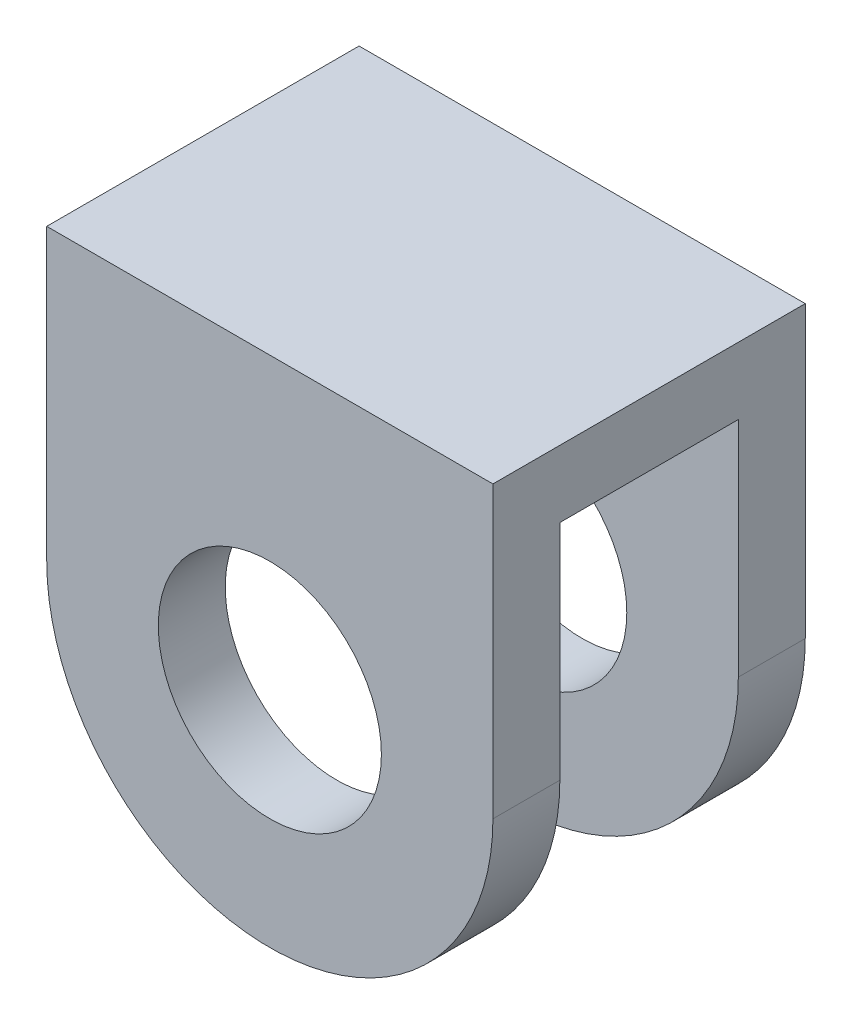
ISO-10303-21;
HEADER;
FILE_DESCRIPTION(('STEP AP214'),'2;1');
FILE_NAME('part.step','',(''),(''),'','','');
FILE_SCHEMA(('AUTOMOTIVE_DESIGN { 1 0 10303 214 1 1 1 1 }'));
ENDSEC;
DATA;
#1=APPLICATION_CONTEXT('core data for automotive mechanical design processes');
#2=APPLICATION_PROTOCOL_DEFINITION('international standard','automotive_design',2000,#1);
#3=PRODUCT_CONTEXT('',#1,'mechanical');
#4=PRODUCT('Part','Part','',(#3));
#5=PRODUCT_RELATED_PRODUCT_CATEGORY('part','',(#4));
#6=PRODUCT_DEFINITION_FORMATION('','',#4);
#7=PRODUCT_DEFINITION_CONTEXT('part definition',#1,'design');
#8=PRODUCT_DEFINITION('design','',#6,#7);
#9=PRODUCT_DEFINITION_SHAPE('','',#8);
#10=(LENGTH_UNIT() NAMED_UNIT(*) SI_UNIT(.MILLI.,.METRE.));
#11=(NAMED_UNIT(*) PLANE_ANGLE_UNIT() SI_UNIT($,.RADIAN.));
#12=(NAMED_UNIT(*) SI_UNIT($,.STERADIAN.) SOLID_ANGLE_UNIT());
#13=UNCERTAINTY_MEASURE_WITH_UNIT(LENGTH_MEASURE(1.E-05),#10,'distance_accuracy_value','');
#14=(GEOMETRIC_REPRESENTATION_CONTEXT(3) GLOBAL_UNCERTAINTY_ASSIGNED_CONTEXT((#13)) GLOBAL_UNIT_ASSIGNED_CONTEXT((#10,
#11,#12)) REPRESENTATION_CONTEXT('',''));
#15=CARTESIAN_POINT('',(0.,0.,0.));
#16=DIRECTION('',(0.,0.,1.));
#17=DIRECTION('',(1.,0.,0.));
#18=AXIS2_PLACEMENT_3D('',#15,#16,#17);
#19=CARTESIAN_POINT('',(0.,55.522572815534,0.));
#20=DIRECTION('',(0.,-1.,0.));
#21=DIRECTION('',(0.,0.,-1.));
#22=AXIS2_PLACEMENT_3D('',#19,#20,#21);
#23=PLANE('',#22);
#24=DIRECTION('',(0.,0.,1.));
#25=VECTOR('',#24,1.);
#26=CARTESIAN_POINT('',(-35.6031553398058,55.522572815534,3.));
#27=LINE('',#26,#25);
#28=CARTESIAN_POINT('',(-35.6031553398058,55.522572815534,-7.99999999999999));
#29=VERTEX_POINT('',#28);
#30=CARTESIAN_POINT('',(-35.6031553398058,55.522572815534,0.));
#31=VERTEX_POINT('',#30);
#32=EDGE_CURVE('E96',#29,#31,#27,.T.);
#33=ORIENTED_EDGE('',*,*,#32,.F.);
#34=DIRECTION('',(-1.,0.,0.));
#35=VECTOR('',#34,1.);
#36=CARTESIAN_POINT('',(-35.6031553398058,55.522572815534,-7.99999999999999));
#37=LINE('',#36,#35);
#38=CARTESIAN_POINT('',(-15.6031553398058,55.522572815534,-8.));
#39=VERTEX_POINT('',#38);
#40=EDGE_CURVE('E95',#39,#29,#37,.T.);
#41=ORIENTED_EDGE('',*,*,#40,.F.);
#42=DIRECTION('',(0.,0.,-1.));
#43=VECTOR('',#42,1.);
#44=CARTESIAN_POINT('',(-15.6031553398058,55.522572815534,-11.));
#45=LINE('',#44,#43);
#46=CARTESIAN_POINT('',(-15.6031553398058,55.522572815534,0.));
#47=VERTEX_POINT('',#46);
#48=EDGE_CURVE('E79',#47,#39,#45,.T.);
#49=ORIENTED_EDGE('',*,*,#48,.F.);
#50=DIRECTION('',(-1.,0.,0.));
#51=VECTOR('',#50,1.);
#52=CARTESIAN_POINT('',(-35.6031553398058,55.522572815534,0.));
#53=LINE('',#52,#51);
#54=EDGE_CURVE('E82',#47,#31,#53,.T.);
#55=ORIENTED_EDGE('',*,*,#54,.T.);
#56=EDGE_LOOP('',(#33,#41,#49,#55));
#57=FACE_BOUND('',#56,.T.);
#58=ADVANCED_FACE('F34',(#57),#23,.T.);
#59=CARTESIAN_POINT('',(-25.6031553398058,45.522572815534,3.));
#60=DIRECTION('',(0.,0.,1.));
#61=DIRECTION('',(1.,0.,0.));
#62=AXIS2_PLACEMENT_3D('',#59,#60,#61);
#63=PLANE('',#62);
#64=DIRECTION('',(0.,-1.,0.));
#65=VECTOR('',#64,1.);
#66=CARTESIAN_POINT('',(-35.6031553398058,45.522572815534,3.));
#67=LINE('',#66,#65);
#68=CARTESIAN_POINT('',(-35.6031553398058,58.522572815534,3.));
#69=VERTEX_POINT('',#68);
#70=CARTESIAN_POINT('',(-35.6031553398058,45.522572815534,3.));
#71=VERTEX_POINT('',#70);
#72=EDGE_CURVE('E93',#69,#71,#67,.T.);
#73=ORIENTED_EDGE('',*,*,#72,.T.);
#74=CARTESIAN_POINT('',(-25.6031553398058,45.522572815534,3.));
#75=DIRECTION('',(0.,0.,1.));
#76=DIRECTION('',(1.,0.,0.));
#77=AXIS2_PLACEMENT_3D('',#74,#75,#76);
#78=CIRCLE('',#77,10.);
#79=CARTESIAN_POINT('',(-15.6031553398058,45.522572815534,3.));
#80=VERTEX_POINT('',#79);
#81=EDGE_CURVE('E58',#71,#80,#78,.T.);
#82=ORIENTED_EDGE('',*,*,#81,.T.);
#83=DIRECTION('',(0.,1.,0.));
#84=VECTOR('',#83,1.);
#85=CARTESIAN_POINT('',(-15.6031553398058,55.522572815534,3.));
#86=LINE('',#85,#84);
#87=CARTESIAN_POINT('',(-15.6031553398058,58.522572815534,3.));
#88=VERTEX_POINT('',#87);
#89=EDGE_CURVE('E123',#80,#88,#86,.T.);
#90=ORIENTED_EDGE('',*,*,#89,.T.);
#91=DIRECTION('',(1.,0.,0.));
#92=VECTOR('',#91,1.);
#93=CARTESIAN_POINT('',(-15.6031553398058,58.522572815534,3.));
#94=LINE('',#93,#92);
#95=EDGE_CURVE('E100',#69,#88,#94,.T.);
#96=ORIENTED_EDGE('',*,*,#95,.F.);
#97=EDGE_LOOP('',(#73,#82,#90,#96));
#98=FACE_BOUND('',#97,.T.);
#99=CARTESIAN_POINT('',(-25.6031553398058,45.522572815534,3.));
#100=DIRECTION('',(0.,0.,1.));
#101=DIRECTION('',(1.,0.,0.));
#102=AXIS2_PLACEMENT_3D('',#99,#100,#101);
#103=CIRCLE('',#102,5.);
#104=CARTESIAN_POINT('',(-20.6031553398058,45.522572815534,3.));
#105=VERTEX_POINT('',#104);
#106=EDGE_CURVE('E116',#105,#105,#103,.T.);
#107=ORIENTED_EDGE('',*,*,#106,.F.);
#108=EDGE_LOOP('',(#107));
#109=FACE_BOUND('',#108,.T.);
#110=ADVANCED_FACE('F164',(#98,#109),#63,.T.);
#111=CARTESIAN_POINT('',(-25.6031553398058,45.522572815534,0.));
#112=DIRECTION('',(0.,0.,1.));
#113=DIRECTION('',(1.,0.,0.));
#114=AXIS2_PLACEMENT_3D('',#111,#112,#113);
#115=PLANE('',#114);
#116=DIRECTION('',(0.,-1.,0.));
#117=VECTOR('',#116,1.);
#118=CARTESIAN_POINT('',(-35.6031553398058,45.522572815534,0.));
#119=LINE('',#118,#117);
#120=CARTESIAN_POINT('',(-35.6031553398058,45.522572815534,0.));
#121=VERTEX_POINT('',#120);
#122=EDGE_CURVE('E90',#31,#121,#119,.T.);
#123=ORIENTED_EDGE('',*,*,#122,.F.);
#124=ORIENTED_EDGE('',*,*,#54,.F.);
#125=DIRECTION('',(0.,1.,0.));
#126=VECTOR('',#125,1.);
#127=CARTESIAN_POINT('',(-15.6031553398058,55.522572815534,0.));
#128=LINE('',#127,#126);
#129=CARTESIAN_POINT('',(-15.6031553398058,45.522572815534,0.));
#130=VERTEX_POINT('',#129);
#131=EDGE_CURVE('E75',#130,#47,#128,.T.);
#132=ORIENTED_EDGE('',*,*,#131,.F.);
#133=CARTESIAN_POINT('',(-25.6031553398058,45.522572815534,0.));
#134=DIRECTION('',(0.,0.,1.));
#135=DIRECTION('',(1.,0.,0.));
#136=AXIS2_PLACEMENT_3D('',#133,#134,#135);
#137=CIRCLE('',#136,10.);
#138=EDGE_CURVE('E83',#121,#130,#137,.T.);
#139=ORIENTED_EDGE('',*,*,#138,.F.);
#140=EDGE_LOOP('',(#123,#124,#132,#139));
#141=FACE_BOUND('',#140,.T.);
#142=CARTESIAN_POINT('',(-25.6031553398058,45.522572815534,0.));
#143=DIRECTION('',(0.,0.,1.));
#144=DIRECTION('',(1.,0.,0.));
#145=AXIS2_PLACEMENT_3D('',#142,#143,#144);
#146=CIRCLE('',#145,5.);
#147=CARTESIAN_POINT('',(-20.6031553398058,45.522572815534,0.));
#148=VERTEX_POINT('',#147);
#149=EDGE_CURVE('E115',#148,#148,#146,.T.);
#150=ORIENTED_EDGE('',*,*,#149,.T.);
#151=EDGE_LOOP('',(#150));
#152=FACE_BOUND('',#151,.T.);
#153=ADVANCED_FACE('F87',(#141,#152),#115,.F.);
#154=CARTESIAN_POINT('',(-35.6031553398058,45.522572815534,3.));
#155=DIRECTION('',(1.,0.,0.));
#156=DIRECTION('',(0.,0.,-1.));
#157=AXIS2_PLACEMENT_3D('',#154,#155,#156);
#158=PLANE('',#157);
#159=ORIENTED_EDGE('',*,*,#122,.T.);
#160=DIRECTION('',(0.,0.,-1.));
#161=VECTOR('',#160,1.);
#162=CARTESIAN_POINT('',(-35.6031553398058,45.522572815534,3.));
#163=LINE('',#162,#161);
#164=EDGE_CURVE('E11',#71,#121,#163,.T.);
#165=ORIENTED_EDGE('',*,*,#164,.F.);
#166=ORIENTED_EDGE('',*,*,#72,.F.);
#167=DIRECTION('',(0.,0.,1.));
#168=VECTOR('',#167,1.);
#169=CARTESIAN_POINT('',(-35.6031553398058,58.522572815534,3.));
#170=LINE('',#169,#168);
#171=CARTESIAN_POINT('',(-35.6031553398058,58.522572815534,-11.));
#172=VERTEX_POINT('',#171);
#173=EDGE_CURVE('E106',#172,#69,#170,.T.);
#174=ORIENTED_EDGE('',*,*,#173,.F.);
#175=DIRECTION('',(0.,-1.,0.));
#176=VECTOR('',#175,1.);
#177=CARTESIAN_POINT('',(-35.6031553398058,58.522572815534,-11.));
#178=LINE('',#177,#176);
#179=CARTESIAN_POINT('',(-35.6031553398058,45.522572815534,-11.));
#180=VERTEX_POINT('',#179);
#181=EDGE_CURVE('E109',#172,#180,#178,.T.);
#182=ORIENTED_EDGE('',*,*,#181,.T.);
#183=DIRECTION('',(0.,0.,1.));
#184=VECTOR('',#183,1.);
#185=CARTESIAN_POINT('',(-35.6031553398058,45.522572815534,-11.));
#186=LINE('',#185,#184);
#187=CARTESIAN_POINT('',(-35.6031553398058,45.522572815534,-7.99999999999999));
#188=VERTEX_POINT('',#187);
#189=EDGE_CURVE('E103',#180,#188,#186,.T.);
#190=ORIENTED_EDGE('',*,*,#189,.T.);
#191=DIRECTION('',(0.,-1.,0.));
#192=VECTOR('',#191,1.);
#193=CARTESIAN_POINT('',(-35.6031553398058,45.522572815534,-7.99999999999999));
#194=LINE('',#193,#192);
#195=EDGE_CURVE('E135',#29,#188,#194,.T.);
#196=ORIENTED_EDGE('',*,*,#195,.F.);
#197=ORIENTED_EDGE('',*,*,#32,.T.);
#198=EDGE_LOOP('',(#159,#165,#166,#174,#182,#190,#196,#197));
#199=FACE_BOUND('',#198,.T.);
#200=ADVANCED_FACE('F36',(#199),#158,.F.);
#201=CARTESIAN_POINT('',(-25.6031553398058,45.522572815534,3.));
#202=DIRECTION('',(0.,0.,-1.));
#203=DIRECTION('',(-1.,0.,0.));
#204=AXIS2_PLACEMENT_3D('',#201,#202,#203);
#205=CYLINDRICAL_SURFACE('',#204,10.);
#206=ORIENTED_EDGE('',*,*,#138,.T.);
#207=DIRECTION('',(0.,0.,-1.));
#208=VECTOR('',#207,1.);
#209=CARTESIAN_POINT('',(-15.6031553398058,45.522572815534,3.));
#210=LINE('',#209,#208);
#211=EDGE_CURVE('E42',#80,#130,#210,.T.);
#212=ORIENTED_EDGE('',*,*,#211,.F.);
#213=ORIENTED_EDGE('',*,*,#81,.F.);
#214=ORIENTED_EDGE('',*,*,#164,.T.);
#215=EDGE_LOOP('',(#206,#212,#213,#214));
#216=FACE_BOUND('',#215,.T.);
#217=ADVANCED_FACE('F127',(#216),#205,.T.);
#218=CARTESIAN_POINT('',(-15.6031553398058,55.522572815534,3.));
#219=DIRECTION('',(-1.,0.,0.));
#220=DIRECTION('',(0.,0.,1.));
#221=AXIS2_PLACEMENT_3D('',#218,#219,#220);
#222=PLANE('',#221);
#223=ORIENTED_EDGE('',*,*,#131,.T.);
#224=ORIENTED_EDGE('',*,*,#48,.T.);
#225=DIRECTION('',(0.,1.,0.));
#226=VECTOR('',#225,1.);
#227=CARTESIAN_POINT('',(-15.6031553398058,55.522572815534,-7.99999999999999));
#228=LINE('',#227,#226);
#229=CARTESIAN_POINT('',(-15.6031553398058,45.522572815534,-7.99999999999999));
#230=VERTEX_POINT('',#229);
#231=EDGE_CURVE('E49',#230,#39,#228,.T.);
#232=ORIENTED_EDGE('',*,*,#231,.F.);
#233=DIRECTION('',(0.,0.,1.));
#234=VECTOR('',#233,1.);
#235=CARTESIAN_POINT('',(-15.6031553398058,45.522572815534,-11.));
#236=LINE('',#235,#234);
#237=CARTESIAN_POINT('',(-15.6031553398058,45.522572815534,-11.));
#238=VERTEX_POINT('',#237);
#239=EDGE_CURVE('E97',#238,#230,#236,.T.);
#240=ORIENTED_EDGE('',*,*,#239,.F.);
#241=DIRECTION('',(0.,-1.,0.));
#242=VECTOR('',#241,1.);
#243=CARTESIAN_POINT('',(-15.6031553398058,58.522572815534,-11.));
#244=LINE('',#243,#242);
#245=CARTESIAN_POINT('',(-15.6031553398058,58.522572815534,-11.));
#246=VERTEX_POINT('',#245);
#247=EDGE_CURVE('E112',#246,#238,#244,.T.);
#248=ORIENTED_EDGE('',*,*,#247,.F.);
#249=DIRECTION('',(0.,0.,-1.));
#250=VECTOR('',#249,1.);
#251=CARTESIAN_POINT('',(-15.6031553398058,58.522572815534,-11.));
#252=LINE('',#251,#250);
#253=EDGE_CURVE('E167',#88,#246,#252,.T.);
#254=ORIENTED_EDGE('',*,*,#253,.F.);
#255=ORIENTED_EDGE('',*,*,#89,.F.);
#256=ORIENTED_EDGE('',*,*,#211,.T.);
#257=EDGE_LOOP('',(#223,#224,#232,#240,#248,#254,#255,#256));
#258=FACE_BOUND('',#257,.T.);
#259=ADVANCED_FACE('F77',(#258),#222,.F.);
#260=CARTESIAN_POINT('',(-25.6031553398058,45.522572815534,3.));
#261=DIRECTION('',(0.,0.,-1.));
#262=DIRECTION('',(-1.,0.,0.));
#263=AXIS2_PLACEMENT_3D('',#260,#261,#262);
#264=CYLINDRICAL_SURFACE('',#263,5.);
#265=ORIENTED_EDGE('',*,*,#106,.T.);
#266=EDGE_LOOP('',(#265));
#267=FACE_BOUND('',#266,.T.);
#268=ORIENTED_EDGE('',*,*,#149,.F.);
#269=EDGE_LOOP('',(#268));
#270=FACE_BOUND('',#269,.T.);
#271=ADVANCED_FACE('F207',(#267,#270),#264,.F.);
#272=CARTESIAN_POINT('',(-35.6031553398058,58.522572815534,-11.));
#273=DIRECTION('',(0.,0.,1.));
#274=DIRECTION('',(1.,0.,0.));
#275=AXIS2_PLACEMENT_3D('',#272,#273,#274);
#276=PLANE('',#275);
#277=ORIENTED_EDGE('',*,*,#247,.T.);
#278=CARTESIAN_POINT('',(-25.6031553398058,45.522572815534,-11.));
#279=DIRECTION('',(0.,0.,1.));
#280=DIRECTION('',(1.,0.,0.));
#281=AXIS2_PLACEMENT_3D('',#278,#279,#280);
#282=CIRCLE('',#281,10.);
#283=EDGE_CURVE('E172',#180,#238,#282,.T.);
#284=ORIENTED_EDGE('',*,*,#283,.F.);
#285=ORIENTED_EDGE('',*,*,#181,.F.);
#286=DIRECTION('',(-1.,0.,0.));
#287=VECTOR('',#286,1.);
#288=CARTESIAN_POINT('',(-35.6031553398058,58.522572815534,-11.));
#289=LINE('',#288,#287);
#290=EDGE_CURVE('E162',#246,#172,#289,.T.);
#291=ORIENTED_EDGE('',*,*,#290,.F.);
#292=EDGE_LOOP('',(#277,#284,#285,#291));
#293=FACE_BOUND('',#292,.T.);
#294=CARTESIAN_POINT('',(-25.6031553398058,45.522572815534,-11.));
#295=DIRECTION('',(0.,0.,1.));
#296=DIRECTION('',(1.,0.,0.));
#297=AXIS2_PLACEMENT_3D('',#294,#295,#296);
#298=CIRCLE('',#297,5.);
#299=CARTESIAN_POINT('',(-20.6031553398058,45.522572815534,-11.));
#300=VERTEX_POINT('',#299);
#301=EDGE_CURVE('E178',#300,#300,#298,.T.);
#302=ORIENTED_EDGE('',*,*,#301,.T.);
#303=EDGE_LOOP('',(#302));
#304=FACE_BOUND('',#303,.T.);
#305=ADVANCED_FACE('F187',(#293,#304),#276,.F.);
#306=CARTESIAN_POINT('',(0.,58.522572815534,0.));
#307=DIRECTION('',(0.,-1.,0.));
#308=DIRECTION('',(0.,0.,-1.));
#309=AXIS2_PLACEMENT_3D('',#306,#307,#308);
#310=PLANE('',#309);
#311=ORIENTED_EDGE('',*,*,#95,.T.);
#312=ORIENTED_EDGE('',*,*,#253,.T.);
#313=ORIENTED_EDGE('',*,*,#290,.T.);
#314=ORIENTED_EDGE('',*,*,#173,.T.);
#315=EDGE_LOOP('',(#311,#312,#313,#314));
#316=FACE_BOUND('',#315,.T.);
#317=ADVANCED_FACE('F160',(#316),#310,.F.);
#318=CARTESIAN_POINT('',(-25.6031553398058,45.522572815534,-11.));
#319=DIRECTION('',(0.,0.,1.));
#320=DIRECTION('',(1.,0.,0.));
#321=AXIS2_PLACEMENT_3D('',#318,#319,#320);
#322=CYLINDRICAL_SURFACE('',#321,10.);
#323=CARTESIAN_POINT('',(-25.6031553398058,45.522572815534,-7.99999999999999));
#324=DIRECTION('',(0.,0.,1.));
#325=DIRECTION('',(1.,0.,0.));
#326=AXIS2_PLACEMENT_3D('',#323,#324,#325);
#327=CIRCLE('',#326,10.);
#328=EDGE_CURVE('E173',#188,#230,#327,.T.);
#329=ORIENTED_EDGE('',*,*,#328,.F.);
#330=ORIENTED_EDGE('',*,*,#189,.F.);
#331=ORIENTED_EDGE('',*,*,#283,.T.);
#332=ORIENTED_EDGE('',*,*,#239,.T.);
#333=EDGE_LOOP('',(#329,#330,#331,#332));
#334=FACE_BOUND('',#333,.T.);
#335=ADVANCED_FACE('F197',(#334),#322,.T.);
#336=CARTESIAN_POINT('',(-25.6031553398058,45.522572815534,-7.99999999999999));
#337=DIRECTION('',(0.,0.,-1.));
#338=DIRECTION('',(1.,0.,0.));
#339=AXIS2_PLACEMENT_3D('',#336,#337,#338);
#340=PLANE('',#339);
#341=CARTESIAN_POINT('',(-25.6031553398058,45.522572815534,-7.99999999999999));
#342=DIRECTION('',(0.,0.,1.));
#343=DIRECTION('',(1.,0.,0.));
#344=AXIS2_PLACEMENT_3D('',#341,#342,#343);
#345=CIRCLE('',#344,5.);
#346=CARTESIAN_POINT('',(-20.6031553398058,45.522572815534,-7.99999999999999));
#347=VERTEX_POINT('',#346);
#348=EDGE_CURVE('E181',#347,#347,#345,.T.);
#349=ORIENTED_EDGE('',*,*,#348,.F.);
#350=EDGE_LOOP('',(#349));
#351=FACE_BOUND('',#350,.T.);
#352=ORIENTED_EDGE('',*,*,#195,.T.);
#353=ORIENTED_EDGE('',*,*,#328,.T.);
#354=ORIENTED_EDGE('',*,*,#231,.T.);
#355=ORIENTED_EDGE('',*,*,#40,.T.);
#356=EDGE_LOOP('',(#352,#353,#354,#355));
#357=FACE_BOUND('',#356,.T.);
#358=ADVANCED_FACE('F192',(#351,#357),#340,.F.);
#359=CARTESIAN_POINT('',(-25.6031553398058,45.522572815534,-11.));
#360=DIRECTION('',(0.,0.,1.));
#361=DIRECTION('',(1.,0.,0.));
#362=AXIS2_PLACEMENT_3D('',#359,#360,#361);
#363=CYLINDRICAL_SURFACE('',#362,5.);
#364=ORIENTED_EDGE('',*,*,#301,.F.);
#365=EDGE_LOOP('',(#364));
#366=FACE_BOUND('',#365,.T.);
#367=ORIENTED_EDGE('',*,*,#348,.T.);
#368=EDGE_LOOP('',(#367));
#369=FACE_BOUND('',#368,.T.);
#370=ADVANCED_FACE('F189',(#366,#369),#363,.F.);
#371=CLOSED_SHELL('',(#58,#110,#153,#200,#217,#259,#271,#305,#317,#335,#358,#370));
#372=MANIFOLD_SOLID_BREP('B2',#371);
#373=ADVANCED_BREP_SHAPE_REPRESENTATION('',(#18,#372),#14);
#374=SHAPE_DEFINITION_REPRESENTATION(#9,#373);
ENDSEC;
END-ISO-10303-21;
